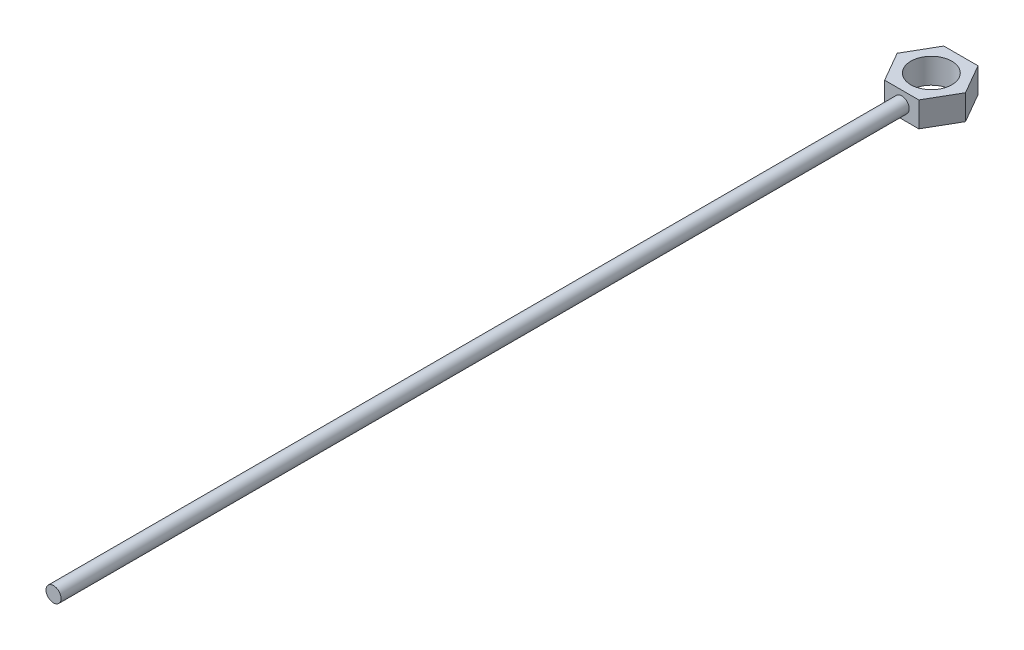
ISO-10303-21;
HEADER;
FILE_DESCRIPTION(('STEP AP214'),'2;1');
FILE_NAME('part.step','',(''),(''),'','','');
FILE_SCHEMA(('AUTOMOTIVE_DESIGN { 1 0 10303 214 1 1 1 1 }'));
ENDSEC;
DATA;
#1=APPLICATION_CONTEXT('core data for automotive mechanical design processes');
#2=APPLICATION_PROTOCOL_DEFINITION('international standard','automotive_design',2000,#1);
#3=PRODUCT_CONTEXT('',#1,'mechanical');
#4=PRODUCT('Part','Part','',(#3));
#5=PRODUCT_RELATED_PRODUCT_CATEGORY('part','',(#4));
#6=PRODUCT_DEFINITION_FORMATION('','',#4);
#7=PRODUCT_DEFINITION_CONTEXT('part definition',#1,'design');
#8=PRODUCT_DEFINITION('design','',#6,#7);
#9=PRODUCT_DEFINITION_SHAPE('','',#8);
#10=(LENGTH_UNIT() NAMED_UNIT(*) SI_UNIT(.MILLI.,.METRE.));
#11=(NAMED_UNIT(*) PLANE_ANGLE_UNIT() SI_UNIT($,.RADIAN.));
#12=(NAMED_UNIT(*) SI_UNIT($,.STERADIAN.) SOLID_ANGLE_UNIT());
#13=UNCERTAINTY_MEASURE_WITH_UNIT(LENGTH_MEASURE(1.E-05),#10,'distance_accuracy_value','');
#14=(GEOMETRIC_REPRESENTATION_CONTEXT(3) GLOBAL_UNCERTAINTY_ASSIGNED_CONTEXT((#13)) GLOBAL_UNIT_ASSIGNED_CONTEXT((#10,
#11,#12)) REPRESENTATION_CONTEXT('',''));
#15=CARTESIAN_POINT('',(0.,0.,0.));
#16=DIRECTION('',(0.,0.,1.));
#17=DIRECTION('',(1.,0.,0.));
#18=AXIS2_PLACEMENT_3D('',#15,#16,#17);
#19=CARTESIAN_POINT('',(-3.46065992120338,5.08,5.99403881124169));
#20=DIRECTION('',(0.,0.,-1.));
#21=DIRECTION('',(-1.,0.,0.));
#22=AXIS2_PLACEMENT_3D('',#19,#20,#21);
#23=PLANE('',#22);
#24=DIRECTION('',(1.,0.,0.));
#25=VECTOR('',#24,1.);
#26=CARTESIAN_POINT('',(-3.46065992120338,0.,5.99403881124169));
#27=LINE('',#26,#25);
#28=CARTESIAN_POINT('',(-3.46065992120338,0.,5.99403881124169));
#29=VERTEX_POINT('',#28);
#30=CARTESIAN_POINT('',(3.46065992120351,0.,5.99403881124162));
#31=VERTEX_POINT('',#30);
#32=EDGE_CURVE('E81',#29,#31,#27,.T.);
#33=ORIENTED_EDGE('',*,*,#32,.T.);
#34=DIRECTION('',(0.,-1.,0.));
#35=VECTOR('',#34,1.);
#36=CARTESIAN_POINT('',(3.46065992120351,5.08,5.99403881124162));
#37=LINE('',#36,#35);
#38=CARTESIAN_POINT('',(3.46065992120351,5.08,5.99403881124162));
#39=VERTEX_POINT('',#38);
#40=EDGE_CURVE('E117',#39,#31,#37,.T.);
#41=ORIENTED_EDGE('',*,*,#40,.F.);
#42=DIRECTION('',(1.,0.,0.));
#43=VECTOR('',#42,1.);
#44=CARTESIAN_POINT('',(-3.46065992120338,5.08,5.99403881124169));
#45=LINE('',#44,#43);
#46=CARTESIAN_POINT('',(-3.46065992120338,5.08,5.99403881124169));
#47=VERTEX_POINT('',#46);
#48=EDGE_CURVE('E52',#47,#39,#45,.T.);
#49=ORIENTED_EDGE('',*,*,#48,.F.);
#50=DIRECTION('',(0.,-1.,0.));
#51=VECTOR('',#50,1.);
#52=CARTESIAN_POINT('',(-3.46065992120338,5.08,5.99403881124169));
#53=LINE('',#52,#51);
#54=EDGE_CURVE('E113',#47,#29,#53,.T.);
#55=ORIENTED_EDGE('',*,*,#54,.T.);
#56=EDGE_LOOP('',(#33,#41,#49,#55));
#57=FACE_BOUND('',#56,.T.);
#58=CARTESIAN_POINT('',(0.,2.54,5.99403881124166));
#59=DIRECTION('',(0.,0.,-1.));
#60=DIRECTION('',(-1.,0.,0.));
#61=AXIS2_PLACEMENT_3D('',#58,#59,#60);
#62=CIRCLE('',#61,1.524);
#63=CARTESIAN_POINT('',(-1.524,2.54,5.99403881124168));
#64=VERTEX_POINT('',#63);
#65=EDGE_CURVE('E11',#64,#64,#62,.F.);
#66=ORIENTED_EDGE('',*,*,#65,.F.);
#67=EDGE_LOOP('',(#66));
#68=FACE_BOUND('',#67,.T.);
#69=ADVANCED_FACE('F33',(#57,#68),#23,.F.);
#70=CARTESIAN_POINT('',(0.,5.08,0.));
#71=DIRECTION('',(0.,1.,0.));
#72=DIRECTION('',(0.,0.,1.));
#73=AXIS2_PLACEMENT_3D('',#70,#71,#72);
#74=PLANE('',#73);
#75=CARTESIAN_POINT('',(0.,5.08,0.));
#76=DIRECTION('',(0.,1.,0.));
#77=DIRECTION('',(0.,0.,1.));
#78=AXIS2_PLACEMENT_3D('',#75,#76,#77);
#79=CIRCLE('',#78,4.14965530350104);
#80=CARTESIAN_POINT('',(0.,5.08,4.14965530350104));
#81=VERTEX_POINT('',#80);
#82=EDGE_CURVE('E153',#81,#81,#79,.T.);
#83=ORIENTED_EDGE('',*,*,#82,.F.);
#84=EDGE_LOOP('',(#83));
#85=FACE_BOUND('',#84,.T.);
#86=DIRECTION('',(0.499999999999995,0.,-0.866025403784442));
#87=VECTOR('',#86,1.);
#88=CARTESIAN_POINT('',(3.46065992120351,5.08,5.99403881124162));
#89=LINE('',#88,#87);
#90=CARTESIAN_POINT('',(6.92131984240688,5.08,0.));
#91=VERTEX_POINT('',#90);
#92=EDGE_CURVE('E132',#39,#91,#89,.T.);
#93=ORIENTED_EDGE('',*,*,#92,.T.);
#94=DIRECTION('',(-0.500000000000001,0.,-0.866025403784438));
#95=VECTOR('',#94,1.);
#96=CARTESIAN_POINT('',(6.92131984240688,5.08,0.));
#97=LINE('',#96,#95);
#98=CARTESIAN_POINT('',(3.46065992120342,5.08,-5.99403881124167));
#99=VERTEX_POINT('',#98);
#100=EDGE_CURVE('E90',#91,#99,#97,.T.);
#101=ORIENTED_EDGE('',*,*,#100,.T.);
#102=DIRECTION('',(-1.,0.,0.));
#103=VECTOR('',#102,1.);
#104=CARTESIAN_POINT('',(3.46065992120342,5.08,-5.99403881124167));
#105=LINE('',#104,#103);
#106=CARTESIAN_POINT('',(-3.46065992120347,5.08,-5.99403881124165));
#107=VERTEX_POINT('',#106);
#108=EDGE_CURVE('E103',#99,#107,#105,.T.);
#109=ORIENTED_EDGE('',*,*,#108,.T.);
#110=DIRECTION('',(-0.499999999999995,0.,0.866025403784441));
#111=VECTOR('',#110,1.);
#112=CARTESIAN_POINT('',(-3.46065992120347,5.08,-5.99403881124165));
#113=LINE('',#112,#111);
#114=CARTESIAN_POINT('',(-6.92131984240688,5.08,0.));
#115=VERTEX_POINT('',#114);
#116=EDGE_CURVE('E97',#107,#115,#113,.T.);
#117=ORIENTED_EDGE('',*,*,#116,.T.);
#118=DIRECTION('',(0.500000000000007,0.,0.866025403784434));
#119=VECTOR('',#118,1.);
#120=CARTESIAN_POINT('',(-6.92131984240688,5.08,0.));
#121=LINE('',#120,#119);
#122=EDGE_CURVE('E101',#115,#47,#121,.T.);
#123=ORIENTED_EDGE('',*,*,#122,.T.);
#124=ORIENTED_EDGE('',*,*,#48,.T.);
#125=EDGE_LOOP('',(#93,#101,#109,#117,#123,#124));
#126=FACE_BOUND('',#125,.T.);
#127=ADVANCED_FACE('F99',(#85,#126),#74,.T.);
#128=CARTESIAN_POINT('',(0.,0.,0.));
#129=DIRECTION('',(0.,1.,0.));
#130=DIRECTION('',(0.,0.,1.));
#131=AXIS2_PLACEMENT_3D('',#128,#129,#130);
#132=PLANE('',#131);
#133=CARTESIAN_POINT('',(0.,0.,0.));
#134=DIRECTION('',(0.,1.,0.));
#135=DIRECTION('',(0.,0.,1.));
#136=AXIS2_PLACEMENT_3D('',#133,#134,#135);
#137=CIRCLE('',#136,4.14965530350104);
#138=CARTESIAN_POINT('',(0.,0.,4.14965530350104));
#139=VERTEX_POINT('',#138);
#140=EDGE_CURVE('E37',#139,#139,#137,.T.);
#141=ORIENTED_EDGE('',*,*,#140,.T.);
#142=EDGE_LOOP('',(#141));
#143=FACE_BOUND('',#142,.T.);
#144=DIRECTION('',(0.499999999999995,0.,-0.866025403784442));
#145=VECTOR('',#144,1.);
#146=CARTESIAN_POINT('',(3.46065992120351,0.,5.99403881124162));
#147=LINE('',#146,#145);
#148=CARTESIAN_POINT('',(6.92131984240688,0.,0.));
#149=VERTEX_POINT('',#148);
#150=EDGE_CURVE('E121',#31,#149,#147,.T.);
#151=ORIENTED_EDGE('',*,*,#150,.F.);
#152=ORIENTED_EDGE('',*,*,#32,.F.);
#153=DIRECTION('',(0.500000000000007,0.,0.866025403784434));
#154=VECTOR('',#153,1.);
#155=CARTESIAN_POINT('',(-6.92131984240688,0.,0.));
#156=LINE('',#155,#154);
#157=CARTESIAN_POINT('',(-6.92131984240688,0.,0.));
#158=VERTEX_POINT('',#157);
#159=EDGE_CURVE('E75',#158,#29,#156,.T.);
#160=ORIENTED_EDGE('',*,*,#159,.F.);
#161=DIRECTION('',(-0.499999999999995,0.,0.866025403784441));
#162=VECTOR('',#161,1.);
#163=CARTESIAN_POINT('',(-3.46065992120347,0.,-5.99403881124165));
#164=LINE('',#163,#162);
#165=CARTESIAN_POINT('',(-3.46065992120347,0.,-5.99403881124165));
#166=VERTEX_POINT('',#165);
#167=EDGE_CURVE('E111',#166,#158,#164,.T.);
#168=ORIENTED_EDGE('',*,*,#167,.F.);
#169=DIRECTION('',(-1.,0.,0.));
#170=VECTOR('',#169,1.);
#171=CARTESIAN_POINT('',(3.46065992120342,0.,-5.99403881124167));
#172=LINE('',#171,#170);
#173=CARTESIAN_POINT('',(3.46065992120342,0.,-5.99403881124167));
#174=VERTEX_POINT('',#173);
#175=EDGE_CURVE('E127',#174,#166,#172,.T.);
#176=ORIENTED_EDGE('',*,*,#175,.F.);
#177=DIRECTION('',(-0.500000000000001,0.,-0.866025403784438));
#178=VECTOR('',#177,1.);
#179=CARTESIAN_POINT('',(6.92131984240688,0.,0.));
#180=LINE('',#179,#178);
#181=EDGE_CURVE('E124',#149,#174,#180,.T.);
#182=ORIENTED_EDGE('',*,*,#181,.F.);
#183=EDGE_LOOP('',(#151,#152,#160,#168,#176,#182));
#184=FACE_BOUND('',#183,.T.);
#185=ADVANCED_FACE('F144',(#143,#184),#132,.F.);
#186=CARTESIAN_POINT('',(3.46065992120351,5.08,5.99403881124162));
#187=DIRECTION('',(-0.866025403784441,0.,-0.499999999999995));
#188=DIRECTION('',(-0.499999999999995,0.,0.866025403784442));
#189=AXIS2_PLACEMENT_3D('',#186,#187,#188);
#190=PLANE('',#189);
#191=ORIENTED_EDGE('',*,*,#150,.T.);
#192=DIRECTION('',(0.,-1.,0.));
#193=VECTOR('',#192,1.);
#194=CARTESIAN_POINT('',(6.92131984240688,5.08,0.));
#195=LINE('',#194,#193);
#196=EDGE_CURVE('E43',#91,#149,#195,.T.);
#197=ORIENTED_EDGE('',*,*,#196,.F.);
#198=ORIENTED_EDGE('',*,*,#92,.F.);
#199=ORIENTED_EDGE('',*,*,#40,.T.);
#200=EDGE_LOOP('',(#191,#197,#198,#199));
#201=FACE_BOUND('',#200,.T.);
#202=ADVANCED_FACE('F35',(#201),#190,.F.);
#203=CARTESIAN_POINT('',(6.92131984240688,5.08,0.));
#204=DIRECTION('',(-0.866025403784438,0.,0.500000000000001));
#205=DIRECTION('',(0.500000000000001,0.,0.866025403784438));
#206=AXIS2_PLACEMENT_3D('',#203,#204,#205);
#207=PLANE('',#206);
#208=ORIENTED_EDGE('',*,*,#181,.T.);
#209=DIRECTION('',(0.,-1.,0.));
#210=VECTOR('',#209,1.);
#211=CARTESIAN_POINT('',(3.46065992120342,5.08,-5.99403881124167));
#212=LINE('',#211,#210);
#213=EDGE_CURVE('E136',#99,#174,#212,.T.);
#214=ORIENTED_EDGE('',*,*,#213,.F.);
#215=ORIENTED_EDGE('',*,*,#100,.F.);
#216=ORIENTED_EDGE('',*,*,#196,.T.);
#217=EDGE_LOOP('',(#208,#214,#215,#216));
#218=FACE_BOUND('',#217,.T.);
#219=ADVANCED_FACE('F139',(#218),#207,.F.);
#220=CARTESIAN_POINT('',(3.46065992120342,5.08,-5.99403881124167));
#221=DIRECTION('',(0.,0.,1.));
#222=DIRECTION('',(1.,0.,0.));
#223=AXIS2_PLACEMENT_3D('',#220,#221,#222);
#224=PLANE('',#223);
#225=ORIENTED_EDGE('',*,*,#175,.T.);
#226=DIRECTION('',(0.,-1.,0.));
#227=VECTOR('',#226,1.);
#228=CARTESIAN_POINT('',(-3.46065992120347,5.08,-5.99403881124165));
#229=LINE('',#228,#227);
#230=EDGE_CURVE('E112',#107,#166,#229,.T.);
#231=ORIENTED_EDGE('',*,*,#230,.F.);
#232=ORIENTED_EDGE('',*,*,#108,.F.);
#233=ORIENTED_EDGE('',*,*,#213,.T.);
#234=EDGE_LOOP('',(#225,#231,#232,#233));
#235=FACE_BOUND('',#234,.T.);
#236=ADVANCED_FACE('F147',(#235),#224,.F.);
#237=CARTESIAN_POINT('',(-3.46065992120347,5.08,-5.99403881124165));
#238=DIRECTION('',(0.866025403784442,0.,0.499999999999995));
#239=DIRECTION('',(0.499999999999995,0.,-0.866025403784442));
#240=AXIS2_PLACEMENT_3D('',#237,#238,#239);
#241=PLANE('',#240);
#242=ORIENTED_EDGE('',*,*,#167,.T.);
#243=DIRECTION('',(0.,-1.,0.));
#244=VECTOR('',#243,1.);
#245=CARTESIAN_POINT('',(-6.92131984240688,5.08,0.));
#246=LINE('',#245,#244);
#247=EDGE_CURVE('E108',#115,#158,#246,.T.);
#248=ORIENTED_EDGE('',*,*,#247,.F.);
#249=ORIENTED_EDGE('',*,*,#116,.F.);
#250=ORIENTED_EDGE('',*,*,#230,.T.);
#251=EDGE_LOOP('',(#242,#248,#249,#250));
#252=FACE_BOUND('',#251,.T.);
#253=ADVANCED_FACE('F109',(#252),#241,.F.);
#254=CARTESIAN_POINT('',(-6.92131984240688,5.08,0.));
#255=DIRECTION('',(0.866025403784434,0.,-0.500000000000007));
#256=DIRECTION('',(-0.500000000000007,0.,-0.866025403784435));
#257=AXIS2_PLACEMENT_3D('',#254,#255,#256);
#258=PLANE('',#257);
#259=ORIENTED_EDGE('',*,*,#159,.T.);
#260=ORIENTED_EDGE('',*,*,#54,.F.);
#261=ORIENTED_EDGE('',*,*,#122,.F.);
#262=ORIENTED_EDGE('',*,*,#247,.T.);
#263=EDGE_LOOP('',(#259,#260,#261,#262));
#264=FACE_BOUND('',#263,.T.);
#265=ADVANCED_FACE('F115',(#264),#258,.F.);
#266=CARTESIAN_POINT('',(0.,2.54,177.8));
#267=DIRECTION('',(0.,0.,-1.));
#268=DIRECTION('',(-1.,0.,0.));
#269=AXIS2_PLACEMENT_3D('',#266,#267,#268);
#270=CYLINDRICAL_SURFACE('',#269,1.524);
#271=CARTESIAN_POINT('',(0.,2.54,177.8));
#272=DIRECTION('',(0.,0.,1.));
#273=DIRECTION('',(1.,0.,0.));
#274=AXIS2_PLACEMENT_3D('',#271,#272,#273);
#275=CIRCLE('',#274,1.524);
#276=CARTESIAN_POINT('',(1.524,2.54,177.8));
#277=VERTEX_POINT('',#276);
#278=EDGE_CURVE('E125',#277,#277,#275,.T.);
#279=ORIENTED_EDGE('',*,*,#278,.F.);
#280=EDGE_LOOP('',(#279));
#281=FACE_BOUND('',#280,.T.);
#282=ORIENTED_EDGE('',*,*,#65,.T.);
#283=EDGE_LOOP('',(#282));
#284=FACE_BOUND('',#283,.T.);
#285=ADVANCED_FACE('F168',(#281,#284),#270,.T.);
#286=CARTESIAN_POINT('',(0.,2.54,177.8));
#287=DIRECTION('',(0.,0.,1.));
#288=DIRECTION('',(1.,0.,0.));
#289=AXIS2_PLACEMENT_3D('',#286,#287,#288);
#290=PLANE('',#289);
#291=ORIENTED_EDGE('',*,*,#278,.T.);
#292=EDGE_LOOP('',(#291));
#293=FACE_BOUND('',#292,.T.);
#294=ADVANCED_FACE('F163',(#293),#290,.T.);
#295=CARTESIAN_POINT('',(0.,-21.336,0.));
#296=DIRECTION('',(0.,1.,0.));
#297=DIRECTION('',(0.,0.,1.));
#298=AXIS2_PLACEMENT_3D('',#295,#296,#297);
#299=CYLINDRICAL_SURFACE('',#298,4.14965530350104);
#300=ORIENTED_EDGE('',*,*,#82,.T.);
#301=EDGE_LOOP('',(#300));
#302=FACE_BOUND('',#301,.T.);
#303=ORIENTED_EDGE('',*,*,#140,.F.);
#304=EDGE_LOOP('',(#303));
#305=FACE_BOUND('',#304,.T.);
#306=ADVANCED_FACE('F161',(#302,#305),#299,.F.);
#307=CLOSED_SHELL('',(#69,#127,#185,#202,#219,#236,#253,#265,#285,#294,#306));
#308=MANIFOLD_SOLID_BREP('B2',#307);
#309=ADVANCED_BREP_SHAPE_REPRESENTATION('',(#18,#308),#14);
#310=SHAPE_DEFINITION_REPRESENTATION(#9,#309);
ENDSEC;
END-ISO-10303-21;
